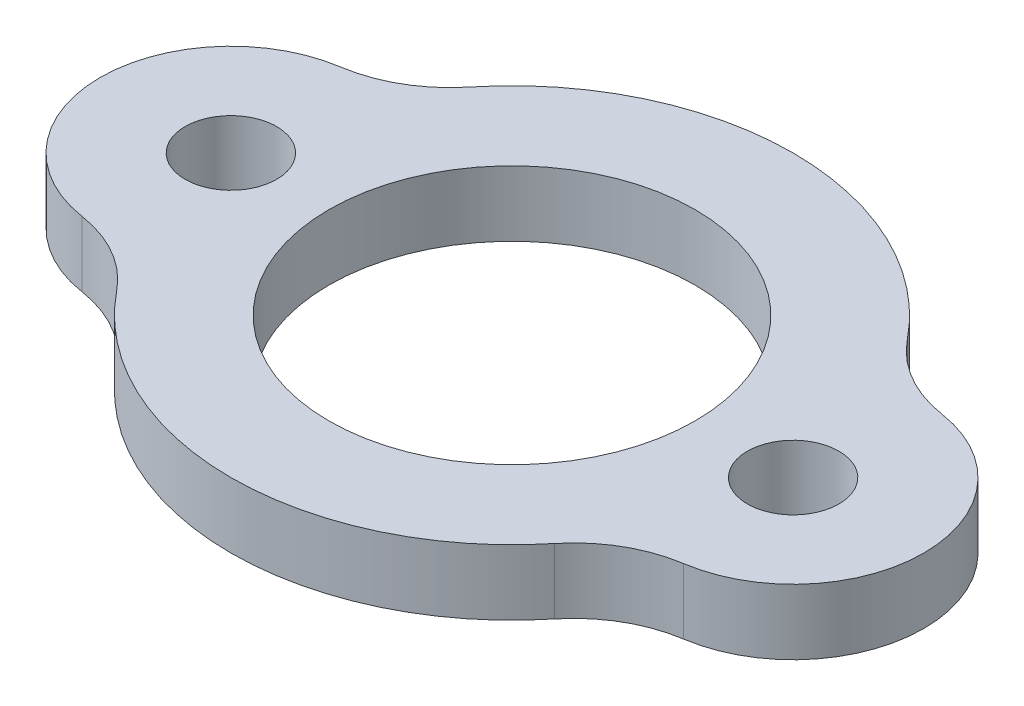
ISO-10303-21;
HEADER;
FILE_DESCRIPTION(('STEP AP214'),'2;1');
FILE_NAME('part.step','',(''),(''),'','','');
FILE_SCHEMA(('AUTOMOTIVE_DESIGN { 1 0 10303 214 1 1 1 1 }'));
ENDSEC;
DATA;
#1=APPLICATION_CONTEXT('core data for automotive mechanical design processes');
#2=APPLICATION_PROTOCOL_DEFINITION('international standard','automotive_design',2000,#1);
#3=PRODUCT_CONTEXT('',#1,'mechanical');
#4=PRODUCT('Part','Part','',(#3));
#5=PRODUCT_RELATED_PRODUCT_CATEGORY('part','',(#4));
#6=PRODUCT_DEFINITION_FORMATION('','',#4);
#7=PRODUCT_DEFINITION_CONTEXT('part definition',#1,'design');
#8=PRODUCT_DEFINITION('design','',#6,#7);
#9=PRODUCT_DEFINITION_SHAPE('','',#8);
#10=(LENGTH_UNIT() NAMED_UNIT(*) SI_UNIT(.MILLI.,.METRE.));
#11=(NAMED_UNIT(*) PLANE_ANGLE_UNIT() SI_UNIT($,.RADIAN.));
#12=(NAMED_UNIT(*) SI_UNIT($,.STERADIAN.) SOLID_ANGLE_UNIT());
#13=UNCERTAINTY_MEASURE_WITH_UNIT(LENGTH_MEASURE(1.E-05),#10,'distance_accuracy_value','');
#14=(GEOMETRIC_REPRESENTATION_CONTEXT(3) GLOBAL_UNCERTAINTY_ASSIGNED_CONTEXT((#13)) GLOBAL_UNIT_ASSIGNED_CONTEXT((#10,
#11,#12)) REPRESENTATION_CONTEXT('',''));
#15=CARTESIAN_POINT('',(0.,0.,0.));
#16=DIRECTION('',(0.,0.,1.));
#17=DIRECTION('',(1.,0.,0.));
#18=AXIS2_PLACEMENT_3D('',#15,#16,#17);
#19=CARTESIAN_POINT('',(-10.75,5.,0.));
#20=DIRECTION('',(0.,1.,0.));
#21=DIRECTION('',(0.,0.,1.));
#22=AXIS2_PLACEMENT_3D('',#19,#20,#21);
#23=PLANE('',#22);
#24=CARTESIAN_POINT('',(-21.5,5.,0.));
#25=DIRECTION('',(0.,1.,0.));
#26=DIRECTION('',(0.,0.,1.));
#27=AXIS2_PLACEMENT_3D('',#24,#25,#26);
#28=CIRCLE('',#27,3.5);
#29=CARTESIAN_POINT('',(-21.5,5.,3.5));
#30=VERTEX_POINT('',#29);
#31=EDGE_CURVE('E185',#30,#30,#28,.T.);
#32=ORIENTED_EDGE('',*,*,#31,.F.);
#33=EDGE_LOOP('',(#32));
#34=FACE_BOUND('',#33,.T.);
#35=CARTESIAN_POINT('',(21.5,5.,0.));
#36=DIRECTION('',(0.,1.,0.));
#37=DIRECTION('',(0.,0.,-1.));
#38=AXIS2_PLACEMENT_3D('',#35,#36,#37);
#39=CIRCLE('',#38,10.);
#40=CARTESIAN_POINT('',(23.0116279069767,5.,9.88508882463122));
#41=VERTEX_POINT('',#40);
#42=CARTESIAN_POINT('',(23.0116279069767,5.,-9.88508882463122));
#43=VERTEX_POINT('',#42);
#44=EDGE_CURVE('E144',#41,#43,#39,.T.);
#45=ORIENTED_EDGE('',*,*,#44,.T.);
#46=CARTESIAN_POINT('',(24.5232558139535,5.,-19.7701776492625));
#47=DIRECTION('',(0.,1.,0.));
#48=DIRECTION('',(0.,0.,1.));
#49=AXIS2_PLACEMENT_3D('',#46,#47,#48);
#50=CIRCLE('',#49,10.);
#51=CARTESIAN_POINT('',(16.7380952380952,5.,-13.4939307764807));
#52=VERTEX_POINT('',#51);
#53=EDGE_CURVE('E160',#43,#52,#50,.F.);
#54=ORIENTED_EDGE('',*,*,#53,.T.);
#55=CARTESIAN_POINT('',(0.,5.,0.));
#56=DIRECTION('',(0.,1.,0.));
#57=DIRECTION('',(0.,0.,1.));
#58=AXIS2_PLACEMENT_3D('',#55,#56,#57);
#59=CIRCLE('',#58,21.5);
#60=CARTESIAN_POINT('',(-16.7380952380952,5.,-13.4939307764807));
#61=VERTEX_POINT('',#60);
#62=EDGE_CURVE('E143',#52,#61,#59,.T.);
#63=ORIENTED_EDGE('',*,*,#62,.T.);
#64=CARTESIAN_POINT('',(-24.5232558139535,5.,-19.7701776492624));
#65=DIRECTION('',(0.,1.,0.));
#66=DIRECTION('',(0.,0.,1.));
#67=AXIS2_PLACEMENT_3D('',#64,#65,#66);
#68=CIRCLE('',#67,10.);
#69=CARTESIAN_POINT('',(-23.0116279069767,5.,-9.88508882463122));
#70=VERTEX_POINT('',#69);
#71=EDGE_CURVE('E115',#61,#70,#68,.F.);
#72=ORIENTED_EDGE('',*,*,#71,.T.);
#73=CARTESIAN_POINT('',(-21.5,5.,0.));
#74=DIRECTION('',(0.,1.,0.));
#75=DIRECTION('',(0.,0.,1.));
#76=AXIS2_PLACEMENT_3D('',#73,#74,#75);
#77=CIRCLE('',#76,10.);
#78=CARTESIAN_POINT('',(-23.0116279069767,5.,9.88508882463122));
#79=VERTEX_POINT('',#78);
#80=EDGE_CURVE('E124',#70,#79,#77,.T.);
#81=ORIENTED_EDGE('',*,*,#80,.T.);
#82=CARTESIAN_POINT('',(-24.5232558139535,5.,19.7701776492625));
#83=DIRECTION('',(0.,1.,0.));
#84=DIRECTION('',(0.,0.,1.));
#85=AXIS2_PLACEMENT_3D('',#82,#83,#84);
#86=CIRCLE('',#85,10.);
#87=CARTESIAN_POINT('',(-16.7380952380952,5.,13.4939307764807));
#88=VERTEX_POINT('',#87);
#89=EDGE_CURVE('E61',#79,#88,#86,.F.);
#90=ORIENTED_EDGE('',*,*,#89,.T.);
#91=CARTESIAN_POINT('',(0.,5.,0.));
#92=DIRECTION('',(0.,1.,0.));
#93=DIRECTION('',(0.,0.,1.));
#94=AXIS2_PLACEMENT_3D('',#91,#92,#93);
#95=CIRCLE('',#94,21.5);
#96=CARTESIAN_POINT('',(16.7380952380952,5.,13.4939307764807));
#97=VERTEX_POINT('',#96);
#98=EDGE_CURVE('E173',#88,#97,#95,.T.);
#99=ORIENTED_EDGE('',*,*,#98,.T.);
#100=CARTESIAN_POINT('',(24.5232558139535,5.,19.7701776492624));
#101=DIRECTION('',(0.,1.,0.));
#102=DIRECTION('',(0.,0.,1.));
#103=AXIS2_PLACEMENT_3D('',#100,#101,#102);
#104=CIRCLE('',#103,10.);
#105=EDGE_CURVE('E11',#97,#41,#104,.F.);
#106=ORIENTED_EDGE('',*,*,#105,.T.);
#107=EDGE_LOOP('',(#45,#54,#63,#72,#81,#90,#99,#106));
#108=FACE_BOUND('',#107,.T.);
#109=CARTESIAN_POINT('',(0.,5.,0.));
#110=DIRECTION('',(0.,1.,0.));
#111=DIRECTION('',(0.,0.,1.));
#112=AXIS2_PLACEMENT_3D('',#109,#110,#111);
#113=CIRCLE('',#112,14.);
#114=CARTESIAN_POINT('',(0.,5.,14.));
#115=VERTEX_POINT('',#114);
#116=EDGE_CURVE('E137',#115,#115,#113,.T.);
#117=ORIENTED_EDGE('',*,*,#116,.F.);
#118=EDGE_LOOP('',(#117));
#119=FACE_BOUND('',#118,.T.);
#120=CARTESIAN_POINT('',(21.5,5.,0.));
#121=DIRECTION('',(0.,1.,0.));
#122=DIRECTION('',(0.,0.,-1.));
#123=AXIS2_PLACEMENT_3D('',#120,#121,#122);
#124=CIRCLE('',#123,3.5);
#125=CARTESIAN_POINT('',(21.5,5.,-3.5));
#126=VERTEX_POINT('',#125);
#127=EDGE_CURVE('E191',#126,#126,#124,.T.);
#128=ORIENTED_EDGE('',*,*,#127,.F.);
#129=EDGE_LOOP('',(#128));
#130=FACE_BOUND('',#129,.T.);
#131=ADVANCED_FACE('F39',(#34,#108,#119,#130),#23,.T.);
#132=CARTESIAN_POINT('',(-10.75,0.,0.));
#133=DIRECTION('',(0.,1.,0.));
#134=DIRECTION('',(0.,0.,1.));
#135=AXIS2_PLACEMENT_3D('',#132,#133,#134);
#136=PLANE('',#135);
#137=CARTESIAN_POINT('',(0.,0.,0.));
#138=DIRECTION('',(0.,1.,0.));
#139=DIRECTION('',(0.,0.,1.));
#140=AXIS2_PLACEMENT_3D('',#137,#138,#139);
#141=CIRCLE('',#140,21.5);
#142=CARTESIAN_POINT('',(16.7380952380952,0.,-13.4939307764807));
#143=VERTEX_POINT('',#142);
#144=CARTESIAN_POINT('',(-16.7380952380952,0.,-13.4939307764807));
#145=VERTEX_POINT('',#144);
#146=EDGE_CURVE('E133',#143,#145,#141,.T.);
#147=ORIENTED_EDGE('',*,*,#146,.F.);
#148=CARTESIAN_POINT('',(24.5232558139535,0.,-19.7701776492625));
#149=DIRECTION('',(0.,1.,0.));
#150=DIRECTION('',(0.,0.,1.));
#151=AXIS2_PLACEMENT_3D('',#148,#149,#150);
#152=CIRCLE('',#151,10.);
#153=CARTESIAN_POINT('',(23.0116279069767,0.,-9.88508882463122));
#154=VERTEX_POINT('',#153);
#155=EDGE_CURVE('E158',#143,#154,#152,.T.);
#156=ORIENTED_EDGE('',*,*,#155,.T.);
#157=CARTESIAN_POINT('',(21.5,0.,0.));
#158=DIRECTION('',(0.,1.,0.));
#159=DIRECTION('',(0.,0.,-1.));
#160=AXIS2_PLACEMENT_3D('',#157,#158,#159);
#161=CIRCLE('',#160,10.);
#162=CARTESIAN_POINT('',(23.0116279069767,0.,9.88508882463122));
#163=VERTEX_POINT('',#162);
#164=EDGE_CURVE('E135',#163,#154,#161,.T.);
#165=ORIENTED_EDGE('',*,*,#164,.F.);
#166=CARTESIAN_POINT('',(24.5232558139535,0.,19.7701776492624));
#167=DIRECTION('',(0.,1.,0.));
#168=DIRECTION('',(0.,0.,1.));
#169=AXIS2_PLACEMENT_3D('',#166,#167,#168);
#170=CIRCLE('',#169,10.);
#171=CARTESIAN_POINT('',(16.7380952380952,0.,13.4939307764807));
#172=VERTEX_POINT('',#171);
#173=EDGE_CURVE('E47',#163,#172,#170,.T.);
#174=ORIENTED_EDGE('',*,*,#173,.T.);
#175=CARTESIAN_POINT('',(0.,0.,0.));
#176=DIRECTION('',(0.,1.,0.));
#177=DIRECTION('',(0.,0.,1.));
#178=AXIS2_PLACEMENT_3D('',#175,#176,#177);
#179=CIRCLE('',#178,21.5);
#180=CARTESIAN_POINT('',(-16.7380952380952,0.,13.4939307764807));
#181=VERTEX_POINT('',#180);
#182=EDGE_CURVE('E132',#181,#172,#179,.T.);
#183=ORIENTED_EDGE('',*,*,#182,.F.);
#184=CARTESIAN_POINT('',(-24.5232558139535,0.,19.7701776492625));
#185=DIRECTION('',(0.,1.,0.));
#186=DIRECTION('',(0.,0.,1.));
#187=AXIS2_PLACEMENT_3D('',#184,#185,#186);
#188=CIRCLE('',#187,10.);
#189=CARTESIAN_POINT('',(-23.0116279069767,0.,9.88508882463122));
#190=VERTEX_POINT('',#189);
#191=EDGE_CURVE('E131',#181,#190,#188,.T.);
#192=ORIENTED_EDGE('',*,*,#191,.T.);
#193=CARTESIAN_POINT('',(-21.5,0.,0.));
#194=DIRECTION('',(0.,1.,0.));
#195=DIRECTION('',(0.,0.,1.));
#196=AXIS2_PLACEMENT_3D('',#193,#194,#195);
#197=CIRCLE('',#196,10.);
#198=CARTESIAN_POINT('',(-23.0116279069767,0.,-9.88508882463122));
#199=VERTEX_POINT('',#198);
#200=EDGE_CURVE('E122',#199,#190,#197,.T.);
#201=ORIENTED_EDGE('',*,*,#200,.F.);
#202=CARTESIAN_POINT('',(-24.5232558139535,0.,-19.7701776492624));
#203=DIRECTION('',(0.,1.,0.));
#204=DIRECTION('',(0.,0.,1.));
#205=AXIS2_PLACEMENT_3D('',#202,#203,#204);
#206=CIRCLE('',#205,10.);
#207=EDGE_CURVE('E105',#199,#145,#206,.T.);
#208=ORIENTED_EDGE('',*,*,#207,.T.);
#209=EDGE_LOOP('',(#147,#156,#165,#174,#183,#192,#201,#208));
#210=FACE_BOUND('',#209,.T.);
#211=CARTESIAN_POINT('',(0.,0.,0.));
#212=DIRECTION('',(0.,1.,0.));
#213=DIRECTION('',(0.,0.,1.));
#214=AXIS2_PLACEMENT_3D('',#211,#212,#213);
#215=CIRCLE('',#214,14.);
#216=CARTESIAN_POINT('',(0.,0.,14.));
#217=VERTEX_POINT('',#216);
#218=EDGE_CURVE('E182',#217,#217,#215,.T.);
#219=ORIENTED_EDGE('',*,*,#218,.T.);
#220=EDGE_LOOP('',(#219));
#221=FACE_BOUND('',#220,.T.);
#222=CARTESIAN_POINT('',(-21.5,0.,0.));
#223=DIRECTION('',(0.,1.,0.));
#224=DIRECTION('',(0.,0.,1.));
#225=AXIS2_PLACEMENT_3D('',#222,#223,#224);
#226=CIRCLE('',#225,3.5);
#227=CARTESIAN_POINT('',(-21.5,0.,3.5));
#228=VERTEX_POINT('',#227);
#229=EDGE_CURVE('E188',#228,#228,#226,.T.);
#230=ORIENTED_EDGE('',*,*,#229,.T.);
#231=EDGE_LOOP('',(#230));
#232=FACE_BOUND('',#231,.T.);
#233=CARTESIAN_POINT('',(21.5,0.,0.));
#234=DIRECTION('',(0.,1.,0.));
#235=DIRECTION('',(0.,0.,-1.));
#236=AXIS2_PLACEMENT_3D('',#233,#234,#235);
#237=CIRCLE('',#236,3.5);
#238=CARTESIAN_POINT('',(21.5,0.,-3.5));
#239=VERTEX_POINT('',#238);
#240=EDGE_CURVE('E194',#239,#239,#237,.T.);
#241=ORIENTED_EDGE('',*,*,#240,.T.);
#242=EDGE_LOOP('',(#241));
#243=FACE_BOUND('',#242,.T.);
#244=ADVANCED_FACE('F128',(#210,#221,#232,#243),#136,.F.);
#245=CARTESIAN_POINT('',(0.,5.,0.));
#246=DIRECTION('',(0.,-1.,0.));
#247=DIRECTION('',(0.,0.,-1.));
#248=AXIS2_PLACEMENT_3D('',#245,#246,#247);
#249=CYLINDRICAL_SURFACE('',#248,21.5);
#250=ORIENTED_EDGE('',*,*,#146,.T.);
#251=DIRECTION('',(0.,-1.,0.));
#252=VECTOR('',#251,1.);
#253=CARTESIAN_POINT('',(-16.7380952380952,5.,-13.4939307764807));
#254=LINE('',#253,#252);
#255=EDGE_CURVE('E110',#145,#61,#254,.F.);
#256=ORIENTED_EDGE('',*,*,#255,.T.);
#257=ORIENTED_EDGE('',*,*,#62,.F.);
#258=DIRECTION('',(0.,-1.,0.));
#259=VECTOR('',#258,1.);
#260=CARTESIAN_POINT('',(16.7380952380952,5.,-13.4939307764807));
#261=LINE('',#260,#259);
#262=EDGE_CURVE('E125',#52,#143,#261,.T.);
#263=ORIENTED_EDGE('',*,*,#262,.T.);
#264=EDGE_LOOP('',(#250,#256,#257,#263));
#265=FACE_BOUND('',#264,.T.);
#266=ADVANCED_FACE('F209',(#265),#249,.T.);
#267=CARTESIAN_POINT('',(-21.5,5.,0.));
#268=DIRECTION('',(0.,-1.,0.));
#269=DIRECTION('',(0.,0.,-1.));
#270=AXIS2_PLACEMENT_3D('',#267,#268,#269);
#271=CYLINDRICAL_SURFACE('',#270,10.);
#272=ORIENTED_EDGE('',*,*,#80,.F.);
#273=DIRECTION('',(0.,-1.,0.));
#274=VECTOR('',#273,1.);
#275=CARTESIAN_POINT('',(-23.0116279069767,5.,-9.88508882463123));
#276=LINE('',#275,#274);
#277=EDGE_CURVE('E109',#70,#199,#276,.T.);
#278=ORIENTED_EDGE('',*,*,#277,.T.);
#279=ORIENTED_EDGE('',*,*,#200,.T.);
#280=DIRECTION('',(0.,-1.,0.));
#281=VECTOR('',#280,1.);
#282=CARTESIAN_POINT('',(-23.0116279069767,5.,9.88508882463123));
#283=LINE('',#282,#281);
#284=EDGE_CURVE('E126',#190,#79,#283,.F.);
#285=ORIENTED_EDGE('',*,*,#284,.T.);
#286=EDGE_LOOP('',(#272,#278,#279,#285));
#287=FACE_BOUND('',#286,.T.);
#288=ADVANCED_FACE('F121',(#287),#271,.T.);
#289=CARTESIAN_POINT('',(0.,5.,0.));
#290=DIRECTION('',(0.,-1.,0.));
#291=DIRECTION('',(0.,0.,-1.));
#292=AXIS2_PLACEMENT_3D('',#289,#290,#291);
#293=CYLINDRICAL_SURFACE('',#292,21.5);
#294=ORIENTED_EDGE('',*,*,#98,.F.);
#295=DIRECTION('',(0.,-1.,0.));
#296=VECTOR('',#295,1.);
#297=CARTESIAN_POINT('',(-16.7380952380952,5.,13.4939307764807));
#298=LINE('',#297,#296);
#299=EDGE_CURVE('E116',#88,#181,#298,.T.);
#300=ORIENTED_EDGE('',*,*,#299,.T.);
#301=ORIENTED_EDGE('',*,*,#182,.T.);
#302=DIRECTION('',(0.,-1.,0.));
#303=VECTOR('',#302,1.);
#304=CARTESIAN_POINT('',(16.7380952380952,5.,13.4939307764807));
#305=LINE('',#304,#303);
#306=EDGE_CURVE('E54',#172,#97,#305,.F.);
#307=ORIENTED_EDGE('',*,*,#306,.T.);
#308=EDGE_LOOP('',(#294,#300,#301,#307));
#309=FACE_BOUND('',#308,.T.);
#310=ADVANCED_FACE('F166',(#309),#293,.T.);
#311=CARTESIAN_POINT('',(21.5,5.,0.));
#312=DIRECTION('',(0.,-1.,0.));
#313=DIRECTION('',(0.,0.,-1.));
#314=AXIS2_PLACEMENT_3D('',#311,#312,#313);
#315=CYLINDRICAL_SURFACE('',#314,10.);
#316=ORIENTED_EDGE('',*,*,#164,.T.);
#317=DIRECTION('',(0.,-1.,0.));
#318=VECTOR('',#317,1.);
#319=CARTESIAN_POINT('',(23.0116279069767,5.,-9.88508882463123));
#320=LINE('',#319,#318);
#321=EDGE_CURVE('E152',#154,#43,#320,.F.);
#322=ORIENTED_EDGE('',*,*,#321,.T.);
#323=ORIENTED_EDGE('',*,*,#44,.F.);
#324=DIRECTION('',(0.,-1.,0.));
#325=VECTOR('',#324,1.);
#326=CARTESIAN_POINT('',(23.0116279069767,5.,9.88508882463123));
#327=LINE('',#326,#325);
#328=EDGE_CURVE('E149',#41,#163,#327,.T.);
#329=ORIENTED_EDGE('',*,*,#328,.T.);
#330=EDGE_LOOP('',(#316,#322,#323,#329));
#331=FACE_BOUND('',#330,.T.);
#332=ADVANCED_FACE('F175',(#331),#315,.T.);
#333=CARTESIAN_POINT('',(0.,5.,0.));
#334=DIRECTION('',(0.,-1.,0.));
#335=DIRECTION('',(0.,0.,-1.));
#336=AXIS2_PLACEMENT_3D('',#333,#334,#335);
#337=CYLINDRICAL_SURFACE('',#336,14.);
#338=ORIENTED_EDGE('',*,*,#116,.T.);
#339=EDGE_LOOP('',(#338));
#340=FACE_BOUND('',#339,.T.);
#341=ORIENTED_EDGE('',*,*,#218,.F.);
#342=EDGE_LOOP('',(#341));
#343=FACE_BOUND('',#342,.T.);
#344=ADVANCED_FACE('F213',(#340,#343),#337,.F.);
#345=CARTESIAN_POINT('',(-21.5,5.,0.));
#346=DIRECTION('',(0.,-1.,0.));
#347=DIRECTION('',(0.,0.,-1.));
#348=AXIS2_PLACEMENT_3D('',#345,#346,#347);
#349=CYLINDRICAL_SURFACE('',#348,3.5);
#350=ORIENTED_EDGE('',*,*,#31,.T.);
#351=EDGE_LOOP('',(#350));
#352=FACE_BOUND('',#351,.T.);
#353=ORIENTED_EDGE('',*,*,#229,.F.);
#354=EDGE_LOOP('',(#353));
#355=FACE_BOUND('',#354,.T.);
#356=ADVANCED_FACE('F301',(#352,#355),#349,.F.);
#357=CARTESIAN_POINT('',(21.5,5.,0.));
#358=DIRECTION('',(0.,-1.,0.));
#359=DIRECTION('',(0.,0.,-1.));
#360=AXIS2_PLACEMENT_3D('',#357,#358,#359);
#361=CYLINDRICAL_SURFACE('',#360,3.5);
#362=ORIENTED_EDGE('',*,*,#127,.T.);
#363=EDGE_LOOP('',(#362));
#364=FACE_BOUND('',#363,.T.);
#365=ORIENTED_EDGE('',*,*,#240,.F.);
#366=EDGE_LOOP('',(#365));
#367=FACE_BOUND('',#366,.T.);
#368=ADVANCED_FACE('F200',(#364,#367),#361,.F.);
#369=CARTESIAN_POINT('',(-24.5232558139535,5.,-19.7701776492624));
#370=DIRECTION('',(0.,1.,0.));
#371=DIRECTION('',(0.,0.,1.));
#372=AXIS2_PLACEMENT_3D('',#369,#370,#371);
#373=CYLINDRICAL_SURFACE('',#372,10.);
#374=ORIENTED_EDGE('',*,*,#71,.F.);
#375=ORIENTED_EDGE('',*,*,#255,.F.);
#376=ORIENTED_EDGE('',*,*,#207,.F.);
#377=ORIENTED_EDGE('',*,*,#277,.F.);
#378=EDGE_LOOP('',(#374,#375,#376,#377));
#379=FACE_BOUND('',#378,.T.);
#380=ADVANCED_FACE('F108',(#379),#373,.F.);
#381=CARTESIAN_POINT('',(24.5232558139535,5.,-19.7701776492625));
#382=DIRECTION('',(0.,1.,0.));
#383=DIRECTION('',(0.,0.,1.));
#384=AXIS2_PLACEMENT_3D('',#381,#382,#383);
#385=CYLINDRICAL_SURFACE('',#384,10.);
#386=ORIENTED_EDGE('',*,*,#53,.F.);
#387=ORIENTED_EDGE('',*,*,#321,.F.);
#388=ORIENTED_EDGE('',*,*,#155,.F.);
#389=ORIENTED_EDGE('',*,*,#262,.F.);
#390=EDGE_LOOP('',(#386,#387,#388,#389));
#391=FACE_BOUND('',#390,.T.);
#392=ADVANCED_FACE('F227',(#391),#385,.F.);
#393=CARTESIAN_POINT('',(-24.5232558139535,5.,19.7701776492625));
#394=DIRECTION('',(0.,1.,0.));
#395=DIRECTION('',(0.,0.,1.));
#396=AXIS2_PLACEMENT_3D('',#393,#394,#395);
#397=CYLINDRICAL_SURFACE('',#396,10.);
#398=ORIENTED_EDGE('',*,*,#89,.F.);
#399=ORIENTED_EDGE('',*,*,#284,.F.);
#400=ORIENTED_EDGE('',*,*,#191,.F.);
#401=ORIENTED_EDGE('',*,*,#299,.F.);
#402=EDGE_LOOP('',(#398,#399,#400,#401));
#403=FACE_BOUND('',#402,.T.);
#404=ADVANCED_FACE('F229',(#403),#397,.F.);
#405=CARTESIAN_POINT('',(24.5232558139535,5.,19.7701776492624));
#406=DIRECTION('',(0.,1.,0.));
#407=DIRECTION('',(0.,0.,1.));
#408=AXIS2_PLACEMENT_3D('',#405,#406,#407);
#409=CYLINDRICAL_SURFACE('',#408,10.);
#410=ORIENTED_EDGE('',*,*,#105,.F.);
#411=ORIENTED_EDGE('',*,*,#306,.F.);
#412=ORIENTED_EDGE('',*,*,#173,.F.);
#413=ORIENTED_EDGE('',*,*,#328,.F.);
#414=EDGE_LOOP('',(#410,#411,#412,#413));
#415=FACE_BOUND('',#414,.T.);
#416=ADVANCED_FACE('F41',(#415),#409,.F.);
#417=CLOSED_SHELL('',(#131,#244,#266,#288,#310,#332,#344,#356,#368,#380,#392,#404,#416));
#418=MANIFOLD_SOLID_BREP('B2',#417);
#419=ADVANCED_BREP_SHAPE_REPRESENTATION('',(#18,#418),#14);
#420=SHAPE_DEFINITION_REPRESENTATION(#9,#419);
ENDSEC;
END-ISO-10303-21;
